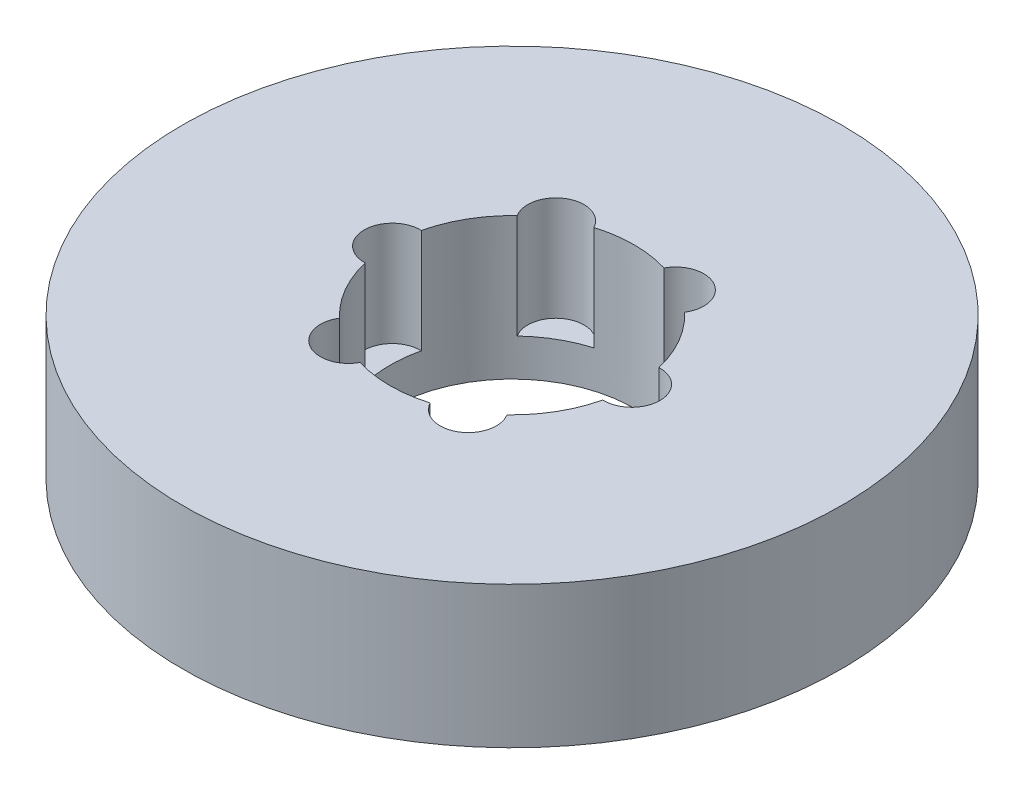
ISO-10303-21;
HEADER;
FILE_DESCRIPTION(('STEP AP214'),'2;1');
FILE_NAME('part.step','',(''),(''),'','','');
FILE_SCHEMA(('AUTOMOTIVE_DESIGN { 1 0 10303 214 1 1 1 1 }'));
ENDSEC;
DATA;
#1=APPLICATION_CONTEXT('core data for automotive mechanical design processes');
#2=APPLICATION_PROTOCOL_DEFINITION('international standard','automotive_design',2000,#1);
#3=PRODUCT_CONTEXT('',#1,'mechanical');
#4=PRODUCT('Part','Part','',(#3));
#5=PRODUCT_RELATED_PRODUCT_CATEGORY('part','',(#4));
#6=PRODUCT_DEFINITION_FORMATION('','',#4);
#7=PRODUCT_DEFINITION_CONTEXT('part definition',#1,'design');
#8=PRODUCT_DEFINITION('design','',#6,#7);
#9=PRODUCT_DEFINITION_SHAPE('','',#8);
#10=(LENGTH_UNIT() NAMED_UNIT(*) SI_UNIT(.MILLI.,.METRE.));
#11=(NAMED_UNIT(*) PLANE_ANGLE_UNIT() SI_UNIT($,.RADIAN.));
#12=(NAMED_UNIT(*) SI_UNIT($,.STERADIAN.) SOLID_ANGLE_UNIT());
#13=UNCERTAINTY_MEASURE_WITH_UNIT(LENGTH_MEASURE(1.E-05),#10,'distance_accuracy_value','');
#14=(GEOMETRIC_REPRESENTATION_CONTEXT(3) GLOBAL_UNCERTAINTY_ASSIGNED_CONTEXT((#13)) GLOBAL_UNIT_ASSIGNED_CONTEXT((#10,
#11,#12)) REPRESENTATION_CONTEXT('',''));
#15=CARTESIAN_POINT('',(0.,0.,0.));
#16=DIRECTION('',(0.,0.,1.));
#17=DIRECTION('',(1.,0.,0.));
#18=AXIS2_PLACEMENT_3D('',#15,#16,#17);
#19=CARTESIAN_POINT('',(0.,29.,0.));
#20=DIRECTION('',(0.,-1.,0.));
#21=DIRECTION('',(0.,0.,-1.));
#22=AXIS2_PLACEMENT_3D('',#19,#20,#21);
#23=CYLINDRICAL_SURFACE('',#22,67.5);
#24=CARTESIAN_POINT('',(0.,29.,0.));
#25=DIRECTION('',(0.,1.,0.));
#26=DIRECTION('',(0.,0.,1.));
#27=AXIS2_PLACEMENT_3D('',#24,#25,#26);
#28=CIRCLE('',#27,67.5);
#29=CARTESIAN_POINT('',(0.,29.,-67.5));
#30=VERTEX_POINT('',#29);
#31=EDGE_CURVE('E171',#30,#30,#28,.T.);
#32=CARTESIAN_POINT('',(0.,0.,0.));
#33=DIRECTION('',(0.,1.,0.));
#34=DIRECTION('',(0.,0.,1.));
#35=AXIS2_PLACEMENT_3D('',#32,#33,#34);
#36=CIRCLE('',#35,67.5);
#37=CARTESIAN_POINT('',(0.,0.,-67.5));
#38=VERTEX_POINT('',#37);
#39=EDGE_CURVE('E157',#38,#38,#36,.T.);
#40=CARTESIAN_POINT('',(0.,29.,-67.5));
#41=CARTESIAN_POINT('',(0.,28.6979166666667,-67.5));
#42=CARTESIAN_POINT('',(0.,28.3958333333333,-67.5));
#43=CARTESIAN_POINT('',(0.,27.7916666666667,-67.5));
#44=CARTESIAN_POINT('',(0.,27.4895833333333,-67.5));
#45=CARTESIAN_POINT('',(0.,26.8854166666667,-67.5));
#46=CARTESIAN_POINT('',(0.,26.5833333333333,-67.5));
#47=CARTESIAN_POINT('',(0.,25.9791666666667,-67.5));
#48=CARTESIAN_POINT('',(0.,25.6770833333333,-67.5));
#49=CARTESIAN_POINT('',(0.,25.0729166666667,-67.5));
#50=CARTESIAN_POINT('',(0.,24.7708333333333,-67.5));
#51=CARTESIAN_POINT('',(0.,24.1666666666667,-67.5));
#52=CARTESIAN_POINT('',(0.,23.8645833333333,-67.5));
#53=CARTESIAN_POINT('',(0.,23.2604166666667,-67.5));
#54=CARTESIAN_POINT('',(0.,22.9583333333333,-67.5));
#55=CARTESIAN_POINT('',(0.,22.3541666666667,-67.5));
#56=CARTESIAN_POINT('',(0.,22.0520833333333,-67.5));
#57=CARTESIAN_POINT('',(0.,21.4479166666667,-67.5));
#58=CARTESIAN_POINT('',(0.,21.1458333333333,-67.5));
#59=CARTESIAN_POINT('',(0.,20.5416666666667,-67.5));
#60=CARTESIAN_POINT('',(0.,20.2395833333333,-67.5));
#61=CARTESIAN_POINT('',(0.,19.6354166666667,-67.5));
#62=CARTESIAN_POINT('',(0.,19.3333333333333,-67.5));
#63=CARTESIAN_POINT('',(0.,18.7291666666667,-67.5));
#64=CARTESIAN_POINT('',(0.,18.4270833333333,-67.5));
#65=CARTESIAN_POINT('',(0.,17.8229166666667,-67.5));
#66=CARTESIAN_POINT('',(0.,17.5208333333333,-67.5));
#67=CARTESIAN_POINT('',(0.,16.9166666666667,-67.5));
#68=CARTESIAN_POINT('',(0.,16.6145833333333,-67.5));
#69=CARTESIAN_POINT('',(0.,16.0104166666667,-67.5));
#70=CARTESIAN_POINT('',(0.,15.7083333333333,-67.5));
#71=CARTESIAN_POINT('',(0.,15.1041666666667,-67.5));
#72=CARTESIAN_POINT('',(0.,14.8020833333333,-67.5));
#73=CARTESIAN_POINT('',(0.,14.1979166666667,-67.5));
#74=CARTESIAN_POINT('',(0.,13.8958333333333,-67.5));
#75=CARTESIAN_POINT('',(0.,13.2916666666667,-67.5));
#76=CARTESIAN_POINT('',(0.,12.9895833333333,-67.5));
#77=CARTESIAN_POINT('',(0.,12.3854166666667,-67.5));
#78=CARTESIAN_POINT('',(0.,12.0833333333333,-67.5));
#79=CARTESIAN_POINT('',(0.,11.4791666666667,-67.5));
#80=CARTESIAN_POINT('',(0.,11.1770833333333,-67.5));
#81=CARTESIAN_POINT('',(0.,10.5729166666667,-67.5));
#82=CARTESIAN_POINT('',(0.,10.2708333333333,-67.5));
#83=CARTESIAN_POINT('',(0.,9.66666666666667,-67.5));
#84=CARTESIAN_POINT('',(0.,9.36458333333333,-67.5));
#85=CARTESIAN_POINT('',(0.,8.76041666666667,-67.5));
#86=CARTESIAN_POINT('',(0.,8.45833333333333,-67.5));
#87=CARTESIAN_POINT('',(0.,7.85416666666667,-67.5));
#88=CARTESIAN_POINT('',(0.,7.55208333333333,-67.5));
#89=CARTESIAN_POINT('',(0.,6.94791666666667,-67.5));
#90=CARTESIAN_POINT('',(0.,6.64583333333333,-67.5));
#91=CARTESIAN_POINT('',(0.,6.04166666666667,-67.5));
#92=CARTESIAN_POINT('',(0.,5.73958333333333,-67.5));
#93=CARTESIAN_POINT('',(0.,5.13541666666667,-67.5));
#94=CARTESIAN_POINT('',(0.,4.83333333333333,-67.5));
#95=CARTESIAN_POINT('',(0.,4.22916666666667,-67.5));
#96=CARTESIAN_POINT('',(0.,3.92708333333333,-67.5));
#97=CARTESIAN_POINT('',(0.,3.32291666666667,-67.5));
#98=CARTESIAN_POINT('',(0.,3.02083333333333,-67.5));
#99=CARTESIAN_POINT('',(0.,2.41666666666667,-67.5));
#100=CARTESIAN_POINT('',(0.,2.11458333333333,-67.5));
#101=CARTESIAN_POINT('',(0.,1.51041666666667,-67.5));
#102=CARTESIAN_POINT('',(0.,1.20833333333333,-67.5));
#103=CARTESIAN_POINT('',(0.,0.604166666666667,-67.5));
#104=CARTESIAN_POINT('',(0.,0.302083333333333,-67.5));
#105=CARTESIAN_POINT('',(0.,0.,-67.5));
#106=B_SPLINE_CURVE_WITH_KNOTS('',3,(#40,#41,#42,#43,#44,#45,#46,#47,#48,#49,#50,#51,#52,#53,
#54,#55,#56,#57,#58,#59,#60,#61,#62,#63,#64,#65,#66,#67,#68,#69,#70,#71,#72,#73,#74,#75,#76,#77,
#78,#79,#80,#81,#82,#83,#84,#85,#86,#87,#88,#89,#90,#91,#92,#93,#94,#95,#96,#97,#98,#99,#100,
#101,#102,#103,#104,#105),.UNSPECIFIED.,.F.,.F.,(4,2,2,2,2,2,2,2,2,2,2,2,2,2,2,2,2,2,2,2,2,2,2,
2,2,2,2,2,2,2,2,2,4),(0.,0.906249999999997,1.8125,2.71875,3.625,4.53125,5.4375,6.34375,7.25,
8.15625,9.0625,9.96875,10.875,11.78125,12.6875,13.59375,14.5,15.40625,16.3125,17.21875,18.125,
19.03125,19.9375,20.84375,21.75,22.65625,23.5625,24.46875,25.375,26.28125,27.1875,28.09375,29.),.UNSPECIFIED.);
#107=EDGE_CURVE('BSEAM39',#30,#38,#106,.T.);
#108=ORIENTED_EDGE('',*,*,#31,.F.);
#109=ORIENTED_EDGE('',*,*,#39,.T.);
#110=ORIENTED_EDGE('',*,*,#107,.T.);
#111=ORIENTED_EDGE('',*,*,#107,.F.);
#112=EDGE_LOOP('',(#108,#110,#109,#111));
#113=FACE_BOUND('',#112,.T.);
#114=ADVANCED_FACE('F39',(#113),#23,.T.);
#115=CARTESIAN_POINT('',(0.,29.,0.));
#116=DIRECTION('',(0.,1.,0.));
#117=DIRECTION('',(0.,0.,1.));
#118=AXIS2_PLACEMENT_3D('',#115,#116,#117);
#119=PLANE('',#118);
#120=CARTESIAN_POINT('',(-12.2617792629325,29.,-21.238024674593));
#121=DIRECTION('',(0.,1.,0.));
#122=DIRECTION('',(-0.866025403784433,0.,0.50000000000001));
#123=AXIS2_PLACEMENT_3D('',#120,#121,#122);
#124=CIRCLE('',#123,5.75942880902693);
#125=CARTESIAN_POINT('',(-7.1792144672522,29.,-23.9470014747817));
#126=VERTEX_POINT('',#125);
#127=CARTESIAN_POINT('',(-17.1491043879987,29.,-18.1908828452476));
#128=VERTEX_POINT('',#127);
#129=EDGE_CURVE('E214',#126,#128,#124,.T.);
#130=ORIENTED_EDGE('',*,*,#129,.F.);
#131=CARTESIAN_POINT('',(0.,29.,0.));
#132=DIRECTION('',(0.,1.,0.));
#133=DIRECTION('',(0.,0.,1.));
#134=AXIS2_PLACEMENT_3D('',#131,#132,#133);
#135=CIRCLE('',#134,25.);
#136=CARTESIAN_POINT('',(7.1792144672517,29.,-23.9470014747818));
#137=VERTEX_POINT('',#136);
#138=EDGE_CURVE('E272',#137,#126,#135,.T.);
#139=ORIENTED_EDGE('',*,*,#138,.F.);
#140=CARTESIAN_POINT('',(12.2617792629321,29.,-21.2380246745932));
#141=DIRECTION('',(0.,1.,0.));
#142=DIRECTION('',(-0.866025403784443,0.,-0.499999999999992));
#143=AXIS2_PLACEMENT_3D('',#140,#141,#142);
#144=CIRCLE('',#143,5.75942880902693);
#145=CARTESIAN_POINT('',(17.1491043879983,29.,-18.190882845248));
#146=VERTEX_POINT('',#145);
#147=EDGE_CURVE('E285',#146,#137,#144,.T.);
#148=ORIENTED_EDGE('',*,*,#147,.F.);
#149=CARTESIAN_POINT('',(24.3283188552504,29.,-5.75611862953396));
#150=VERTEX_POINT('',#149);
#151=EDGE_CURVE('E165',#150,#146,#135,.T.);
#152=ORIENTED_EDGE('',*,*,#151,.F.);
#153=CARTESIAN_POINT('',(24.5235585258645,29.,0.));
#154=DIRECTION('',(0.,1.,0.));
#155=DIRECTION('',(0.,0.,-1.));
#156=AXIS2_PLACEMENT_3D('',#153,#154,#155);
#157=CIRCLE('',#156,5.75942880902693);
#158=CARTESIAN_POINT('',(24.3283188552504,29.,5.75611862953396));
#159=VERTEX_POINT('',#158);
#160=EDGE_CURVE('E281',#159,#150,#157,.T.);
#161=ORIENTED_EDGE('',*,*,#160,.F.);
#162=CARTESIAN_POINT('',(17.1491043879986,29.,18.1908828452477));
#163=VERTEX_POINT('',#162);
#164=EDGE_CURVE('E160',#163,#159,#135,.T.);
#165=ORIENTED_EDGE('',*,*,#164,.F.);
#166=CARTESIAN_POINT('',(12.2617792629324,29.,21.2380246745931));
#167=DIRECTION('',(0.,1.,0.));
#168=DIRECTION('',(0.866025403784436,0.,-0.500000000000004));
#169=AXIS2_PLACEMENT_3D('',#166,#167,#168);
#170=CIRCLE('',#169,5.75942880902693);
#171=CARTESIAN_POINT('',(7.17921446725204,29.,23.9470014747817));
#172=VERTEX_POINT('',#171);
#173=EDGE_CURVE('E154',#172,#163,#170,.T.);
#174=ORIENTED_EDGE('',*,*,#173,.F.);
#175=CARTESIAN_POINT('',(-7.17921446725187,29.,23.9470014747818));
#176=VERTEX_POINT('',#175);
#177=EDGE_CURVE('E150',#176,#172,#135,.T.);
#178=ORIENTED_EDGE('',*,*,#177,.F.);
#179=CARTESIAN_POINT('',(-12.2617792629322,29.,21.2380246745932));
#180=DIRECTION('',(0.,1.,0.));
#181=DIRECTION('',(0.86602540378444,0.,0.499999999999998));
#182=AXIS2_PLACEMENT_3D('',#179,#180,#181);
#183=CIRCLE('',#182,5.75942880902693);
#184=CARTESIAN_POINT('',(-17.1491043879984,29.,18.1908828452479));
#185=VERTEX_POINT('',#184);
#186=EDGE_CURVE('E127',#185,#176,#183,.T.);
#187=ORIENTED_EDGE('',*,*,#186,.F.);
#188=CARTESIAN_POINT('',(-24.3283188552504,29.,5.75611862953396));
#189=VERTEX_POINT('',#188);
#190=EDGE_CURVE('E156',#189,#185,#135,.T.);
#191=ORIENTED_EDGE('',*,*,#190,.F.);
#192=CARTESIAN_POINT('',(-24.5235585258645,29.,0.));
#193=DIRECTION('',(0.,1.,0.));
#194=DIRECTION('',(0.,0.,1.));
#195=AXIS2_PLACEMENT_3D('',#192,#193,#194);
#196=CIRCLE('',#195,5.75942880902693);
#197=CARTESIAN_POINT('',(-24.3283188552504,29.,-5.75611862953396));
#198=VERTEX_POINT('',#197);
#199=EDGE_CURVE('E164',#198,#189,#196,.T.);
#200=ORIENTED_EDGE('',*,*,#199,.F.);
#201=EDGE_CURVE('E159',#128,#198,#135,.T.);
#202=ORIENTED_EDGE('',*,*,#201,.F.);
#203=EDGE_LOOP('',(#130,#139,#148,#152,#161,#165,#174,#178,#187,#191,#200,#202));
#204=FACE_BOUND('',#203,.T.);
#205=ORIENTED_EDGE('',*,*,#31,.T.);
#206=EDGE_LOOP('',(#205));
#207=FACE_BOUND('',#206,.T.);
#208=ADVANCED_FACE('F155',(#204,#207),#119,.T.);
#209=CARTESIAN_POINT('',(0.,0.,0.));
#210=DIRECTION('',(0.,1.,0.));
#211=DIRECTION('',(0.,0.,1.));
#212=AXIS2_PLACEMENT_3D('',#209,#210,#211);
#213=PLANE('',#212);
#214=CARTESIAN_POINT('',(0.,0.,0.));
#215=DIRECTION('',(0.,1.,0.));
#216=DIRECTION('',(0.,0.,1.));
#217=AXIS2_PLACEMENT_3D('',#214,#215,#216);
#218=CIRCLE('',#217,25.);
#219=CARTESIAN_POINT('',(0.,0.,25.));
#220=VERTEX_POINT('',#219);
#221=EDGE_CURVE('E170',#220,#220,#218,.T.);
#222=ORIENTED_EDGE('',*,*,#221,.T.);
#223=EDGE_LOOP('',(#222));
#224=FACE_BOUND('',#223,.T.);
#225=ORIENTED_EDGE('',*,*,#39,.F.);
#226=EDGE_LOOP('',(#225));
#227=FACE_BOUND('',#226,.T.);
#228=ADVANCED_FACE('F232',(#224,#227),#213,.F.);
#229=CARTESIAN_POINT('',(0.,29.,0.));
#230=DIRECTION('',(0.,-1.,0.));
#231=DIRECTION('',(0.,0.,-1.));
#232=AXIS2_PLACEMENT_3D('',#229,#230,#231);
#233=CYLINDRICAL_SURFACE('',#232,25.);
#234=DIRECTION('',(0.,1.,0.));
#235=VECTOR('',#234,1.);
#236=CARTESIAN_POINT('',(-7.1792144672522,18.3218207684039,-23.9470014747817));
#237=LINE('',#236,#235);
#238=CARTESIAN_POINT('',(-7.1792144672522,7.64364153680777,-23.9470014747817));
#239=VERTEX_POINT('',#238);
#240=EDGE_CURVE('E11',#239,#126,#237,.T.);
#241=ORIENTED_EDGE('',*,*,#240,.F.);
#242=CARTESIAN_POINT('',(0.,7.64364153680777,0.));
#243=DIRECTION('',(0.,1.,0.));
#244=DIRECTION('',(0.,0.,1.));
#245=AXIS2_PLACEMENT_3D('',#242,#243,#244);
#246=CIRCLE('',#245,25.);
#247=CARTESIAN_POINT('',(-17.1491043879987,7.64364153680777,-18.1908828452476));
#248=VERTEX_POINT('',#247);
#249=EDGE_CURVE('E209',#239,#248,#246,.T.);
#250=ORIENTED_EDGE('',*,*,#249,.T.);
#251=DIRECTION('',(0.,1.,0.));
#252=VECTOR('',#251,1.);
#253=CARTESIAN_POINT('',(-17.1491043879987,18.3218207684039,-18.1908828452476));
#254=LINE('',#253,#252);
#255=EDGE_CURVE('E46',#128,#248,#254,.F.);
#256=ORIENTED_EDGE('',*,*,#255,.F.);
#257=ORIENTED_EDGE('',*,*,#201,.T.);
#258=DIRECTION('',(0.,1.,0.));
#259=VECTOR('',#258,1.);
#260=CARTESIAN_POINT('',(-24.3283188552504,18.3218207684039,-5.75611862953396));
#261=LINE('',#260,#259);
#262=CARTESIAN_POINT('',(-24.3283188552504,7.64364153680777,-5.75611862953396));
#263=VERTEX_POINT('',#262);
#264=EDGE_CURVE('E185',#263,#198,#261,.T.);
#265=ORIENTED_EDGE('',*,*,#264,.F.);
#266=CARTESIAN_POINT('',(0.,7.64364153680777,0.));
#267=DIRECTION('',(0.,1.,0.));
#268=DIRECTION('',(0.,0.,1.));
#269=AXIS2_PLACEMENT_3D('',#266,#267,#268);
#270=CIRCLE('',#269,25.);
#271=CARTESIAN_POINT('',(-24.3283188552504,7.64364153680777,5.75611862953396));
#272=VERTEX_POINT('',#271);
#273=EDGE_CURVE('E173',#263,#272,#270,.T.);
#274=ORIENTED_EDGE('',*,*,#273,.T.);
#275=DIRECTION('',(0.,1.,0.));
#276=VECTOR('',#275,1.);
#277=CARTESIAN_POINT('',(-24.3283188552504,18.3218207684039,5.75611862953396));
#278=LINE('',#277,#276);
#279=EDGE_CURVE('E178',#189,#272,#278,.F.);
#280=ORIENTED_EDGE('',*,*,#279,.F.);
#281=ORIENTED_EDGE('',*,*,#190,.T.);
#282=DIRECTION('',(0.,1.,0.));
#283=VECTOR('',#282,1.);
#284=CARTESIAN_POINT('',(-17.1491043879984,18.3218207684039,18.1908828452479));
#285=LINE('',#284,#283);
#286=CARTESIAN_POINT('',(-17.1491043879984,7.64364153680777,18.1908828452479));
#287=VERTEX_POINT('',#286);
#288=EDGE_CURVE('E132',#287,#185,#285,.T.);
#289=ORIENTED_EDGE('',*,*,#288,.F.);
#290=CARTESIAN_POINT('',(0.,7.64364153680777,0.));
#291=DIRECTION('',(0.,1.,0.));
#292=DIRECTION('',(0.,0.,1.));
#293=AXIS2_PLACEMENT_3D('',#290,#291,#292);
#294=CIRCLE('',#293,25.);
#295=CARTESIAN_POINT('',(-7.17921446725187,7.64364153680777,23.9470014747818));
#296=VERTEX_POINT('',#295);
#297=EDGE_CURVE('E146',#287,#296,#294,.T.);
#298=ORIENTED_EDGE('',*,*,#297,.T.);
#299=DIRECTION('',(0.,1.,0.));
#300=VECTOR('',#299,1.);
#301=CARTESIAN_POINT('',(-7.17921446725187,18.3218207684039,23.9470014747818));
#302=LINE('',#301,#300);
#303=EDGE_CURVE('E128',#176,#296,#302,.F.);
#304=ORIENTED_EDGE('',*,*,#303,.F.);
#305=ORIENTED_EDGE('',*,*,#177,.T.);
#306=DIRECTION('',(0.,1.,0.));
#307=VECTOR('',#306,1.);
#308=CARTESIAN_POINT('',(7.17921446725203,18.3218207684039,23.9470014747817));
#309=LINE('',#308,#307);
#310=CARTESIAN_POINT('',(7.17921446725204,7.64364153680777,23.9470014747817));
#311=VERTEX_POINT('',#310);
#312=EDGE_CURVE('E192',#311,#172,#309,.T.);
#313=ORIENTED_EDGE('',*,*,#312,.F.);
#314=CARTESIAN_POINT('',(0.,7.64364153680777,0.));
#315=DIRECTION('',(0.,1.,0.));
#316=DIRECTION('',(0.,0.,1.));
#317=AXIS2_PLACEMENT_3D('',#314,#315,#316);
#318=CIRCLE('',#317,25.);
#319=CARTESIAN_POINT('',(17.1491043879986,7.64364153680777,18.1908828452477));
#320=VERTEX_POINT('',#319);
#321=EDGE_CURVE('E190',#311,#320,#318,.T.);
#322=ORIENTED_EDGE('',*,*,#321,.T.);
#323=DIRECTION('',(0.,1.,0.));
#324=VECTOR('',#323,1.);
#325=CARTESIAN_POINT('',(17.1491043879986,18.3218207684039,18.1908828452477));
#326=LINE('',#325,#324);
#327=EDGE_CURVE('E189',#163,#320,#326,.F.);
#328=ORIENTED_EDGE('',*,*,#327,.F.);
#329=ORIENTED_EDGE('',*,*,#164,.T.);
#330=DIRECTION('',(0.,1.,0.));
#331=VECTOR('',#330,1.);
#332=CARTESIAN_POINT('',(24.3283188552504,18.3218207684039,5.75611862953396));
#333=LINE('',#332,#331);
#334=CARTESIAN_POINT('',(24.3283188552504,7.64364153680777,5.75611862953396));
#335=VERTEX_POINT('',#334);
#336=EDGE_CURVE('E203',#335,#159,#333,.T.);
#337=ORIENTED_EDGE('',*,*,#336,.F.);
#338=CARTESIAN_POINT('',(0.,7.64364153680777,0.));
#339=DIRECTION('',(0.,1.,0.));
#340=DIRECTION('',(0.,0.,1.));
#341=AXIS2_PLACEMENT_3D('',#338,#339,#340);
#342=CIRCLE('',#341,25.);
#343=CARTESIAN_POINT('',(24.3283188552504,7.64364153680777,-5.75611862953396));
#344=VERTEX_POINT('',#343);
#345=EDGE_CURVE('E194',#335,#344,#342,.T.);
#346=ORIENTED_EDGE('',*,*,#345,.T.);
#347=DIRECTION('',(0.,1.,0.));
#348=VECTOR('',#347,1.);
#349=CARTESIAN_POINT('',(24.3283188552504,18.3218207684039,-5.75611862953396));
#350=LINE('',#349,#348);
#351=EDGE_CURVE('E196',#150,#344,#350,.F.);
#352=ORIENTED_EDGE('',*,*,#351,.F.);
#353=ORIENTED_EDGE('',*,*,#151,.T.);
#354=DIRECTION('',(0.,1.,0.));
#355=VECTOR('',#354,1.);
#356=CARTESIAN_POINT('',(17.1491043879983,18.3218207684039,-18.190882845248));
#357=LINE('',#356,#355);
#358=CARTESIAN_POINT('',(17.1491043879983,7.64364153680777,-18.190882845248));
#359=VERTEX_POINT('',#358);
#360=EDGE_CURVE('E208',#359,#146,#357,.T.);
#361=ORIENTED_EDGE('',*,*,#360,.F.);
#362=CARTESIAN_POINT('',(0.,7.64364153680777,0.));
#363=DIRECTION('',(0.,1.,0.));
#364=DIRECTION('',(0.,0.,1.));
#365=AXIS2_PLACEMENT_3D('',#362,#363,#364);
#366=CIRCLE('',#365,25.);
#367=CARTESIAN_POINT('',(7.1792144672517,7.64364153680777,-23.9470014747818));
#368=VERTEX_POINT('',#367);
#369=EDGE_CURVE('E201',#359,#368,#366,.T.);
#370=ORIENTED_EDGE('',*,*,#369,.T.);
#371=DIRECTION('',(0.,1.,0.));
#372=VECTOR('',#371,1.);
#373=CARTESIAN_POINT('',(7.1792144672517,18.3218207684039,-23.9470014747818));
#374=LINE('',#373,#372);
#375=EDGE_CURVE('E206',#137,#368,#374,.F.);
#376=ORIENTED_EDGE('',*,*,#375,.F.);
#377=ORIENTED_EDGE('',*,*,#138,.T.);
#378=EDGE_LOOP('',(#241,#250,#256,#257,#265,#274,#280,#281,#289,#298,#304,#305,#313,#322,#328,
#329,#337,#346,#352,#353,#361,#370,#376,#377));
#379=FACE_BOUND('',#378,.T.);
#380=ORIENTED_EDGE('',*,*,#221,.F.);
#381=EDGE_LOOP('',(#380));
#382=FACE_BOUND('',#381,.T.);
#383=ADVANCED_FACE('F145',(#379,#382),#233,.F.);
#384=CARTESIAN_POINT('',(-24.5235585258645,7.64364153680777,0.));
#385=DIRECTION('',(0.,1.,0.));
#386=DIRECTION('',(0.,0.,1.));
#387=AXIS2_PLACEMENT_3D('',#384,#385,#386);
#388=CYLINDRICAL_SURFACE('',#387,5.75942880902693);
#389=ORIENTED_EDGE('',*,*,#264,.T.);
#390=ORIENTED_EDGE('',*,*,#199,.T.);
#391=ORIENTED_EDGE('',*,*,#279,.T.);
#392=CARTESIAN_POINT('',(-24.5235585258645,7.64364153680777,0.));
#393=DIRECTION('',(0.,1.,0.));
#394=DIRECTION('',(0.,0.,1.));
#395=AXIS2_PLACEMENT_3D('',#392,#393,#394);
#396=CIRCLE('',#395,5.75942880902693);
#397=EDGE_CURVE('E168',#263,#272,#396,.T.);
#398=ORIENTED_EDGE('',*,*,#397,.F.);
#399=EDGE_LOOP('',(#389,#390,#391,#398));
#400=FACE_BOUND('',#399,.T.);
#401=ADVANCED_FACE('F243',(#400),#388,.F.);
#402=CARTESIAN_POINT('',(-24.5235585258645,7.64364153680777,0.));
#403=DIRECTION('',(0.,1.,0.));
#404=DIRECTION('',(0.,0.,1.));
#405=AXIS2_PLACEMENT_3D('',#402,#403,#404);
#406=PLANE('',#405);
#407=ORIENTED_EDGE('',*,*,#397,.T.);
#408=ORIENTED_EDGE('',*,*,#273,.F.);
#409=EDGE_LOOP('',(#407,#408));
#410=FACE_BOUND('',#409,.T.);
#411=ADVANCED_FACE('F247',(#410),#406,.T.);
#412=CARTESIAN_POINT('',(-12.2617792629322,7.64364153680777,21.2380246745932));
#413=DIRECTION('',(0.,1.,0.));
#414=DIRECTION('',(0.,0.,1.));
#415=AXIS2_PLACEMENT_3D('',#412,#413,#414);
#416=CYLINDRICAL_SURFACE('',#415,5.75942880902693);
#417=ORIENTED_EDGE('',*,*,#288,.T.);
#418=ORIENTED_EDGE('',*,*,#186,.T.);
#419=ORIENTED_EDGE('',*,*,#303,.T.);
#420=CARTESIAN_POINT('',(-12.2617792629322,7.64364153680777,21.2380246745932));
#421=DIRECTION('',(0.,1.,0.));
#422=DIRECTION('',(0.86602540378444,0.,0.499999999999998));
#423=AXIS2_PLACEMENT_3D('',#420,#421,#422);
#424=CIRCLE('',#423,5.75942880902693);
#425=EDGE_CURVE('E137',#287,#296,#424,.T.);
#426=ORIENTED_EDGE('',*,*,#425,.F.);
#427=EDGE_LOOP('',(#417,#418,#419,#426));
#428=FACE_BOUND('',#427,.T.);
#429=ADVANCED_FACE('F126',(#428),#416,.F.);
#430=CARTESIAN_POINT('',(-12.2617792629322,7.64364153680777,21.2380246745932));
#431=DIRECTION('',(0.,1.,0.));
#432=DIRECTION('',(0.86602540378444,0.,0.499999999999998));
#433=AXIS2_PLACEMENT_3D('',#430,#431,#432);
#434=PLANE('',#433);
#435=ORIENTED_EDGE('',*,*,#425,.T.);
#436=ORIENTED_EDGE('',*,*,#297,.F.);
#437=EDGE_LOOP('',(#435,#436));
#438=FACE_BOUND('',#437,.T.);
#439=ADVANCED_FACE('F254',(#438),#434,.T.);
#440=CARTESIAN_POINT('',(12.2617792629324,7.64364153680777,21.2380246745931));
#441=DIRECTION('',(0.,1.,0.));
#442=DIRECTION('',(0.,0.,1.));
#443=AXIS2_PLACEMENT_3D('',#440,#441,#442);
#444=CYLINDRICAL_SURFACE('',#443,5.75942880902693);
#445=ORIENTED_EDGE('',*,*,#312,.T.);
#446=ORIENTED_EDGE('',*,*,#173,.T.);
#447=ORIENTED_EDGE('',*,*,#327,.T.);
#448=CARTESIAN_POINT('',(12.2617792629324,7.64364153680777,21.2380246745931));
#449=DIRECTION('',(0.,1.,0.));
#450=DIRECTION('',(0.866025403784436,0.,-0.500000000000004));
#451=AXIS2_PLACEMENT_3D('',#448,#449,#450);
#452=CIRCLE('',#451,5.75942880902693);
#453=EDGE_CURVE('E138',#311,#320,#452,.T.);
#454=ORIENTED_EDGE('',*,*,#453,.F.);
#455=EDGE_LOOP('',(#445,#446,#447,#454));
#456=FACE_BOUND('',#455,.T.);
#457=ADVANCED_FACE('F260',(#456),#444,.F.);
#458=CARTESIAN_POINT('',(12.2617792629324,7.64364153680777,21.2380246745931));
#459=DIRECTION('',(0.,1.,0.));
#460=DIRECTION('',(0.866025403784436,0.,-0.500000000000004));
#461=AXIS2_PLACEMENT_3D('',#458,#459,#460);
#462=PLANE('',#461);
#463=ORIENTED_EDGE('',*,*,#453,.T.);
#464=ORIENTED_EDGE('',*,*,#321,.F.);
#465=EDGE_LOOP('',(#463,#464));
#466=FACE_BOUND('',#465,.T.);
#467=ADVANCED_FACE('F265',(#466),#462,.T.);
#468=CARTESIAN_POINT('',(24.5235585258645,7.64364153680777,0.));
#469=DIRECTION('',(0.,1.,0.));
#470=DIRECTION('',(0.,0.,1.));
#471=AXIS2_PLACEMENT_3D('',#468,#469,#470);
#472=CYLINDRICAL_SURFACE('',#471,5.75942880902693);
#473=ORIENTED_EDGE('',*,*,#336,.T.);
#474=ORIENTED_EDGE('',*,*,#160,.T.);
#475=ORIENTED_EDGE('',*,*,#351,.T.);
#476=CARTESIAN_POINT('',(24.5235585258645,7.64364153680777,0.));
#477=DIRECTION('',(0.,1.,0.));
#478=DIRECTION('',(0.,0.,-1.));
#479=AXIS2_PLACEMENT_3D('',#476,#477,#478);
#480=CIRCLE('',#479,5.75942880902693);
#481=EDGE_CURVE('E287',#335,#344,#480,.T.);
#482=ORIENTED_EDGE('',*,*,#481,.F.);
#483=EDGE_LOOP('',(#473,#474,#475,#482));
#484=FACE_BOUND('',#483,.T.);
#485=ADVANCED_FACE('F300',(#484),#472,.F.);
#486=CARTESIAN_POINT('',(24.5235585258645,7.64364153680777,0.));
#487=DIRECTION('',(0.,1.,0.));
#488=DIRECTION('',(0.,0.,-1.));
#489=AXIS2_PLACEMENT_3D('',#486,#487,#488);
#490=PLANE('',#489);
#491=ORIENTED_EDGE('',*,*,#481,.T.);
#492=ORIENTED_EDGE('',*,*,#345,.F.);
#493=EDGE_LOOP('',(#491,#492));
#494=FACE_BOUND('',#493,.T.);
#495=ADVANCED_FACE('F298',(#494),#490,.T.);
#496=CARTESIAN_POINT('',(12.2617792629321,7.64364153680777,-21.2380246745932));
#497=DIRECTION('',(0.,1.,0.));
#498=DIRECTION('',(0.,0.,1.));
#499=AXIS2_PLACEMENT_3D('',#496,#497,#498);
#500=CYLINDRICAL_SURFACE('',#499,5.75942880902693);
#501=ORIENTED_EDGE('',*,*,#360,.T.);
#502=ORIENTED_EDGE('',*,*,#147,.T.);
#503=ORIENTED_EDGE('',*,*,#375,.T.);
#504=CARTESIAN_POINT('',(12.2617792629321,7.64364153680777,-21.2380246745932));
#505=DIRECTION('',(0.,1.,0.));
#506=DIRECTION('',(-0.866025403784443,0.,-0.499999999999992));
#507=AXIS2_PLACEMENT_3D('',#504,#505,#506);
#508=CIRCLE('',#507,5.75942880902693);
#509=EDGE_CURVE('E56',#359,#368,#508,.T.);
#510=ORIENTED_EDGE('',*,*,#509,.F.);
#511=EDGE_LOOP('',(#501,#502,#503,#510));
#512=FACE_BOUND('',#511,.T.);
#513=ADVANCED_FACE('F301',(#512),#500,.F.);
#514=CARTESIAN_POINT('',(12.2617792629321,7.64364153680777,-21.2380246745932));
#515=DIRECTION('',(0.,1.,0.));
#516=DIRECTION('',(-0.866025403784443,0.,-0.499999999999992));
#517=AXIS2_PLACEMENT_3D('',#514,#515,#516);
#518=PLANE('',#517);
#519=ORIENTED_EDGE('',*,*,#509,.T.);
#520=ORIENTED_EDGE('',*,*,#369,.F.);
#521=EDGE_LOOP('',(#519,#520));
#522=FACE_BOUND('',#521,.T.);
#523=ADVANCED_FACE('F221',(#522),#518,.T.);
#524=CARTESIAN_POINT('',(-12.2617792629325,7.64364153680777,-21.238024674593));
#525=DIRECTION('',(0.,1.,0.));
#526=DIRECTION('',(0.,0.,1.));
#527=AXIS2_PLACEMENT_3D('',#524,#525,#526);
#528=CYLINDRICAL_SURFACE('',#527,5.75942880902693);
#529=ORIENTED_EDGE('',*,*,#240,.T.);
#530=ORIENTED_EDGE('',*,*,#129,.T.);
#531=ORIENTED_EDGE('',*,*,#255,.T.);
#532=CARTESIAN_POINT('',(-12.2617792629325,7.64364153680777,-21.238024674593));
#533=DIRECTION('',(0.,1.,0.));
#534=DIRECTION('',(-0.866025403784433,0.,0.50000000000001));
#535=AXIS2_PLACEMENT_3D('',#532,#533,#534);
#536=CIRCLE('',#535,5.75942880902693);
#537=EDGE_CURVE('E55',#239,#248,#536,.T.);
#538=ORIENTED_EDGE('',*,*,#537,.F.);
#539=EDGE_LOOP('',(#529,#530,#531,#538));
#540=FACE_BOUND('',#539,.T.);
#541=ADVANCED_FACE('F212',(#540),#528,.F.);
#542=CARTESIAN_POINT('',(-12.2617792629325,7.64364153680777,-21.238024674593));
#543=DIRECTION('',(0.,1.,0.));
#544=DIRECTION('',(-0.866025403784433,0.,0.50000000000001));
#545=AXIS2_PLACEMENT_3D('',#542,#543,#544);
#546=PLANE('',#545);
#547=ORIENTED_EDGE('',*,*,#537,.T.);
#548=ORIENTED_EDGE('',*,*,#249,.F.);
#549=EDGE_LOOP('',(#547,#548));
#550=FACE_BOUND('',#549,.T.);
#551=ADVANCED_FACE('F217',(#550),#546,.T.);
#552=CLOSED_SHELL('',(#114,#208,#228,#383,#401,#411,#429,#439,#457,#467,#485,#495,#513,#523,
#541,#551));
#553=MANIFOLD_SOLID_BREP('B2',#552);
#554=ADVANCED_BREP_SHAPE_REPRESENTATION('',(#18,#553),#14);
#555=SHAPE_DEFINITION_REPRESENTATION(#9,#554);
ENDSEC;
END-ISO-10303-21;
